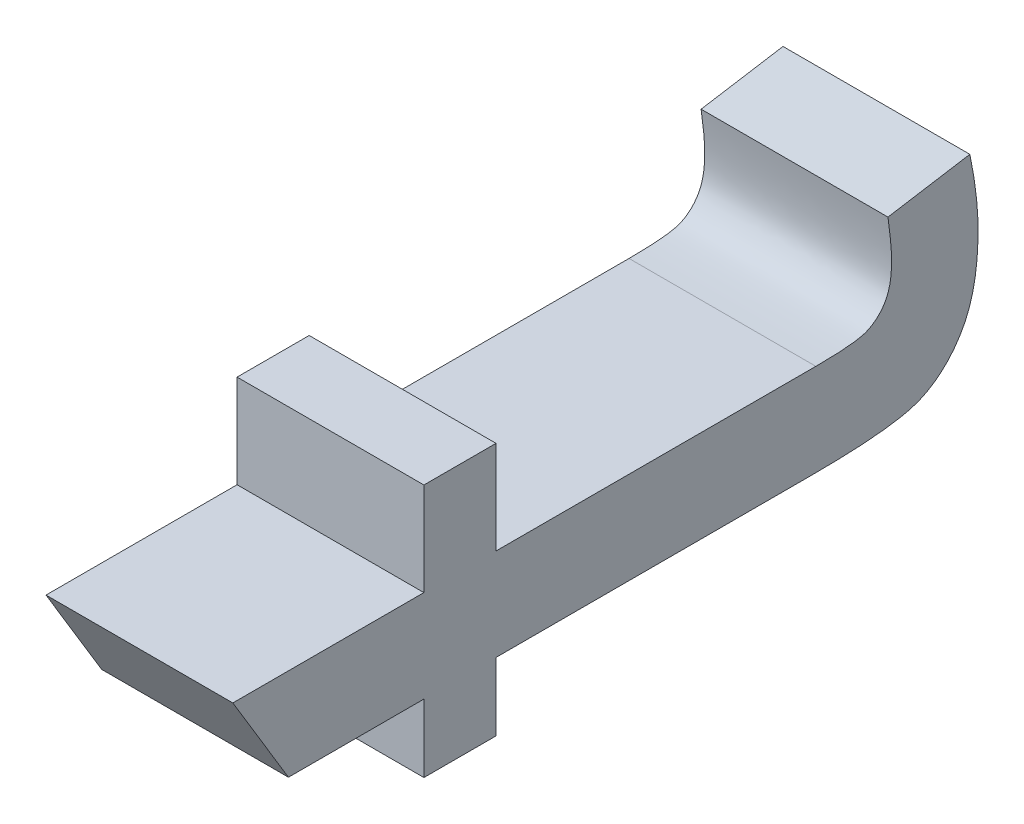
ISO-10303-21;
HEADER;
FILE_DESCRIPTION(('STEP AP214'),'2;1');
FILE_NAME('part.step','',(''),(''),'','','');
FILE_SCHEMA(('AUTOMOTIVE_DESIGN { 1 0 10303 214 1 1 1 1 }'));
ENDSEC;
DATA;
#1=APPLICATION_CONTEXT('core data for automotive mechanical design processes');
#2=APPLICATION_PROTOCOL_DEFINITION('international standard','automotive_design',2000,#1);
#3=PRODUCT_CONTEXT('',#1,'mechanical');
#4=PRODUCT('Part','Part','',(#3));
#5=PRODUCT_RELATED_PRODUCT_CATEGORY('part','',(#4));
#6=PRODUCT_DEFINITION_FORMATION('','',#4);
#7=PRODUCT_DEFINITION_CONTEXT('part definition',#1,'design');
#8=PRODUCT_DEFINITION('design','',#6,#7);
#9=PRODUCT_DEFINITION_SHAPE('','',#8);
#10=(LENGTH_UNIT() NAMED_UNIT(*) SI_UNIT(.MILLI.,.METRE.));
#11=(NAMED_UNIT(*) PLANE_ANGLE_UNIT() SI_UNIT($,.RADIAN.));
#12=(NAMED_UNIT(*) SI_UNIT($,.STERADIAN.) SOLID_ANGLE_UNIT());
#13=UNCERTAINTY_MEASURE_WITH_UNIT(LENGTH_MEASURE(1.E-05),#10,'distance_accuracy_value','');
#14=(GEOMETRIC_REPRESENTATION_CONTEXT(3) GLOBAL_UNCERTAINTY_ASSIGNED_CONTEXT((#13)) GLOBAL_UNIT_ASSIGNED_CONTEXT((#10,
#11,#12)) REPRESENTATION_CONTEXT('',''));
#15=CARTESIAN_POINT('',(0.,0.,0.));
#16=DIRECTION('',(0.,0.,1.));
#17=DIRECTION('',(1.,0.,0.));
#18=AXIS2_PLACEMENT_3D('',#15,#16,#17);
#19=CARTESIAN_POINT('',(4.55229940712883,-37.2465420082194,-8.76729471927808));
#20=DIRECTION('',(-1.,0.,0.));
#21=DIRECTION('',(0.,0.,1.));
#22=AXIS2_PLACEMENT_3D('',#19,#20,#21);
#23=PLANE('',#22);
#24=CARTESIAN_POINT('',(4.55229940712883,-37.1923071708471,-8.84692414060429));
#25=CARTESIAN_POINT('',(4.55229940712882,-37.1676361774808,-8.83203884851735));
#26=CARTESIAN_POINT('',(4.55229940712882,-37.1429651841145,-8.81715355643041));
#27=(BOUNDED_CURVE() B_SPLINE_CURVE(2,(#24,#25,#26),.UNSPECIFIED.,.F.,
.F.) B_SPLINE_CURVE_WITH_KNOTS((3,3),(30.,31.),
.UNSPECIFIED.) CURVE() GEOMETRIC_REPRESENTATION_ITEM() RATIONAL_B_SPLINE_CURVE((1.,1.,1.)) REPRESENTATION_ITEM(''));
#28=CARTESIAN_POINT('',(4.55229940712883,-37.1923071708471,-8.84692414060429));
#29=VERTEX_POINT('',#28);
#30=CARTESIAN_POINT('',(4.55229940712882,-37.1429651841145,-8.81715355643041));
#31=VERTEX_POINT('',#30);
#32=EDGE_CURVE('E287',#29,#31,#27,.T.);
#33=ORIENTED_EDGE('',*,*,#32,.T.);
#34=CARTESIAN_POINT('',(4.55229940712882,-37.1429651841145,-8.81715355643041));
#35=CARTESIAN_POINT('',(4.55229940712882,-37.1429651841145,-8.86828729128463));
#36=CARTESIAN_POINT('',(4.55229940712882,-37.1429651841145,-8.91942102613884));
#37=(BOUNDED_CURVE() B_SPLINE_CURVE(2,(#34,#35,#36),.UNSPECIFIED.,.F.,
.F.) B_SPLINE_CURVE_WITH_KNOTS((3,3),(31.,32.),
.UNSPECIFIED.) CURVE() GEOMETRIC_REPRESENTATION_ITEM() RATIONAL_B_SPLINE_CURVE((1.,1.,1.)) REPRESENTATION_ITEM(''));
#38=CARTESIAN_POINT('',(4.55229940712882,-37.1429651841145,-8.91942102613884));
#39=VERTEX_POINT('',#38);
#40=EDGE_CURVE('E125',#31,#39,#37,.T.);
#41=ORIENTED_EDGE('',*,*,#40,.T.);
#42=CARTESIAN_POINT('',(4.55229940712882,-37.1429651841145,-8.91942102613884));
#43=CARTESIAN_POINT('',(4.55229940712882,-37.118018537191,-8.91942102613884));
#44=CARTESIAN_POINT('',(4.55229940712881,-37.0930718902675,-8.91942102613884));
#45=(BOUNDED_CURVE() B_SPLINE_CURVE(2,(#42,#43,#44),.UNSPECIFIED.,.F.,
.F.) B_SPLINE_CURVE_WITH_KNOTS((3,3),(32.,33.),
.UNSPECIFIED.) CURVE() GEOMETRIC_REPRESENTATION_ITEM() RATIONAL_B_SPLINE_CURVE((1.,1.,1.)) REPRESENTATION_ITEM(''));
#46=CARTESIAN_POINT('',(4.55229940712881,-37.0930718902675,-8.91942102613884));
#47=VERTEX_POINT('',#46);
#48=EDGE_CURVE('E122',#39,#47,#45,.T.);
#49=ORIENTED_EDGE('',*,*,#48,.T.);
#50=CARTESIAN_POINT('',(4.55229940712881,-37.0930718902675,-8.91942102613884));
#51=CARTESIAN_POINT('',(4.55229940712881,-37.0930718902675,-8.93871677514042));
#52=CARTESIAN_POINT('',(4.55229940712881,-37.0930718902675,-8.95801252414201));
#53=(BOUNDED_CURVE() B_SPLINE_CURVE(2,(#50,#51,#52),.UNSPECIFIED.,.F.,
.F.) B_SPLINE_CURVE_WITH_KNOTS((3,3),(33.,34.),
.UNSPECIFIED.) CURVE() GEOMETRIC_REPRESENTATION_ITEM() RATIONAL_B_SPLINE_CURVE((1.,1.,1.)) REPRESENTATION_ITEM(''));
#54=CARTESIAN_POINT('',(4.55229940712881,-37.0930718902675,-8.95801252414201));
#55=VERTEX_POINT('',#54);
#56=EDGE_CURVE('E107',#47,#55,#53,.T.);
#57=ORIENTED_EDGE('',*,*,#56,.T.);
#58=CARTESIAN_POINT('',(4.55229940712881,-37.0930718902675,-8.95801252414201));
#59=CARTESIAN_POINT('',(4.55229940712882,-37.118018537191,-8.95801252414201));
#60=CARTESIAN_POINT('',(4.55229940712882,-37.1429651841145,-8.95801252414201));
#61=(BOUNDED_CURVE() B_SPLINE_CURVE(2,(#58,#59,#60),.UNSPECIFIED.,.F.,
.F.) B_SPLINE_CURVE_WITH_KNOTS((3,3),(34.,35.),
.UNSPECIFIED.) CURVE() GEOMETRIC_REPRESENTATION_ITEM() RATIONAL_B_SPLINE_CURVE((1.,1.,1.)) REPRESENTATION_ITEM(''));
#62=CARTESIAN_POINT('',(4.55229940712882,-37.1429651841145,-8.95801252414201));
#63=VERTEX_POINT('',#62);
#64=EDGE_CURVE('E172',#55,#63,#61,.T.);
#65=ORIENTED_EDGE('',*,*,#64,.T.);
#66=CARTESIAN_POINT('',(4.55229940712882,-37.1429651841145,-8.95801252414201));
#67=CARTESIAN_POINT('',(4.55229940712882,-37.1429651841145,-9.04360295364191));
#68=CARTESIAN_POINT('',(4.55229940712882,-37.1429651841145,-9.12919338314181));
#69=(BOUNDED_CURVE() B_SPLINE_CURVE(2,(#66,#67,#68),.UNSPECIFIED.,.F.,
.F.) B_SPLINE_CURVE_WITH_KNOTS((3,3),(35.,36.),
.UNSPECIFIED.) CURVE() GEOMETRIC_REPRESENTATION_ITEM() RATIONAL_B_SPLINE_CURVE((1.,1.,1.)) REPRESENTATION_ITEM(''));
#70=CARTESIAN_POINT('',(4.55229940712882,-37.1429651841145,-9.12919338314181));
#71=VERTEX_POINT('',#70);
#72=EDGE_CURVE('E201',#63,#71,#69,.T.);
#73=ORIENTED_EDGE('',*,*,#72,.T.);
#74=CARTESIAN_POINT('',(4.55229940712882,-37.1429651841145,-9.12919338314181));
#75=CARTESIAN_POINT('',(4.55229940712882,-37.1429651841145,-9.15041870704355));
#76=CARTESIAN_POINT('',(4.55229940712882,-37.1403464753214,-9.1564830853012));
#77=CARTESIAN_POINT('',(4.55229940712882,-37.1377277665284,-9.16254746355884));
#78=CARTESIAN_POINT('',(4.55229940712882,-37.1318012150493,-9.16613095980199));
#79=CARTESIAN_POINT('',(4.55229940712882,-37.1258746635702,-9.16971445604514));
#80=CARTESIAN_POINT('',(4.55229940712882,-37.1148485212836,-9.16971445604514));
#81=CARTESIAN_POINT('',(4.55229940712882,-37.1065789145687,-9.16971445604514));
#82=CARTESIAN_POINT('',(4.55229940712882,-37.0930718902675,-9.16778488114498));
#83=(BOUNDED_CURVE() B_SPLINE_CURVE(2,(#74,#75,#76,#77,#78,#79,#80,#81,#82),.UNSPECIFIED.,.F.,
.F.) B_SPLINE_CURVE_WITH_KNOTS((3,2,2,2,3),(36.,37.,38.,39.,40.),
.UNSPECIFIED.) CURVE() GEOMETRIC_REPRESENTATION_ITEM() RATIONAL_B_SPLINE_CURVE((1.,1.,1.,1.,1.,
1.,1.,1.,1.)) REPRESENTATION_ITEM(''));
#84=CARTESIAN_POINT('',(4.55229940712882,-37.0930718902675,-9.16778488114498));
#85=VERTEX_POINT('',#84);
#86=EDGE_CURVE('E173',#71,#85,#83,.T.);
#87=ORIENTED_EDGE('',*,*,#86,.T.);
#88=CARTESIAN_POINT('',(4.55229940712882,-37.0930718902675,-9.16778488114498));
#89=CARTESIAN_POINT('',(4.55229940712882,-37.0894883940244,-9.18969933893964));
#90=CARTESIAN_POINT('',(4.55229940712882,-37.0859048977812,-9.21161379673431));
#91=(BOUNDED_CURVE() B_SPLINE_CURVE(2,(#88,#89,#90),.UNSPECIFIED.,.F.,
.F.) B_SPLINE_CURVE_WITH_KNOTS((3,3),(40.,41.),
.UNSPECIFIED.) CURVE() GEOMETRIC_REPRESENTATION_ITEM() RATIONAL_B_SPLINE_CURVE((1.,1.,1.)) REPRESENTATION_ITEM(''));
#92=CARTESIAN_POINT('',(4.55229940712882,-37.0859048977812,-9.21161379673431));
#93=VERTEX_POINT('',#92);
#94=EDGE_CURVE('E202',#85,#93,#91,.T.);
#95=ORIENTED_EDGE('',*,*,#94,.T.);
#96=CARTESIAN_POINT('',(4.55229940712882,-37.0859048977812,-9.21161379673431));
#97=CARTESIAN_POINT('',(4.55229940712882,-37.1068545681258,-9.21602425364895));
#98=CARTESIAN_POINT('',(4.55229940712882,-37.1233937815558,-9.21602425364895));
#99=CARTESIAN_POINT('',(4.55229940712882,-37.150407830158,-9.21602425364895));
#100=CARTESIAN_POINT('',(4.55229940712883,-37.1652931222449,-9.20747899337682));
#101=CARTESIAN_POINT('',(4.55229940712883,-37.1801784143318,-9.19893373310469));
#102=CARTESIAN_POINT('',(4.55229940712883,-37.1862427925895,-9.18501322846783));
#103=CARTESIAN_POINT('',(4.55229940712883,-37.1923071708471,-9.17109272383097));
#104=CARTESIAN_POINT('',(4.55229940712883,-37.1923071708471,-9.12643684757015));
#105=(BOUNDED_CURVE() B_SPLINE_CURVE(2,(#96,#97,#98,#99,#100,#101,#102,#103,#104),.UNSPECIFIED.,
.F.,.F.) B_SPLINE_CURVE_WITH_KNOTS((3,2,2,2,3),(41.,42.,43.,44.,45.),
.UNSPECIFIED.) CURVE() GEOMETRIC_REPRESENTATION_ITEM() RATIONAL_B_SPLINE_CURVE((1.,1.,1.,1.,1.,
1.,1.,1.,1.)) REPRESENTATION_ITEM(''));
#106=CARTESIAN_POINT('',(4.55229940712883,-37.1923071708471,-9.12643684757015));
#107=VERTEX_POINT('',#106);
#108=EDGE_CURVE('E228',#93,#107,#105,.T.);
#109=ORIENTED_EDGE('',*,*,#108,.T.);
#110=CARTESIAN_POINT('',(4.55229940712883,-37.1923071708471,-9.12643684757015));
#111=CARTESIAN_POINT('',(4.55229940712883,-37.1923071708471,-9.04222468585608));
#112=CARTESIAN_POINT('',(4.55229940712883,-37.1923071708471,-8.95801252414201));
#113=(BOUNDED_CURVE() B_SPLINE_CURVE(2,(#110,#111,#112),.UNSPECIFIED.,.F.,
.F.) B_SPLINE_CURVE_WITH_KNOTS((3,3),(45.,46.),
.UNSPECIFIED.) CURVE() GEOMETRIC_REPRESENTATION_ITEM() RATIONAL_B_SPLINE_CURVE((1.,1.,1.)) REPRESENTATION_ITEM(''));
#114=CARTESIAN_POINT('',(4.55229940712883,-37.1923071708471,-8.95801252414201));
#115=VERTEX_POINT('',#114);
#116=EDGE_CURVE('E314',#107,#115,#113,.T.);
#117=ORIENTED_EDGE('',*,*,#116,.T.);
#118=CARTESIAN_POINT('',(4.55229940712883,-37.1923071708471,-8.95801252414201));
#119=CARTESIAN_POINT('',(4.55229940712883,-37.2105003056201,-8.95801252414201));
#120=CARTESIAN_POINT('',(4.55229940712883,-37.228693440393,-8.95801252414201));
#121=(BOUNDED_CURVE() B_SPLINE_CURVE(2,(#118,#119,#120),.UNSPECIFIED.,.F.,
.F.) B_SPLINE_CURVE_WITH_KNOTS((3,3),(46.,47.),
.UNSPECIFIED.) CURVE() GEOMETRIC_REPRESENTATION_ITEM() RATIONAL_B_SPLINE_CURVE((1.,1.,1.)) REPRESENTATION_ITEM(''));
#122=CARTESIAN_POINT('',(4.55229940712883,-37.228693440393,-8.95801252414201));
#123=VERTEX_POINT('',#122);
#124=EDGE_CURVE('E146',#115,#123,#121,.T.);
#125=ORIENTED_EDGE('',*,*,#124,.T.);
#126=CARTESIAN_POINT('',(4.55229940712883,-37.228693440393,-8.95801252414201));
#127=CARTESIAN_POINT('',(4.55229940712883,-37.228693440393,-8.93871677514042));
#128=CARTESIAN_POINT('',(4.55229940712883,-37.228693440393,-8.91942102613884));
#129=(BOUNDED_CURVE() B_SPLINE_CURVE(2,(#126,#127,#128),.UNSPECIFIED.,.F.,
.F.) B_SPLINE_CURVE_WITH_KNOTS((3,3),(47.,48.),
.UNSPECIFIED.) CURVE() GEOMETRIC_REPRESENTATION_ITEM() RATIONAL_B_SPLINE_CURVE((1.,1.,1.)) REPRESENTATION_ITEM(''));
#130=CARTESIAN_POINT('',(4.55229940712883,-37.228693440393,-8.91942102613884));
#131=VERTEX_POINT('',#130);
#132=EDGE_CURVE('E339',#123,#131,#129,.T.);
#133=ORIENTED_EDGE('',*,*,#132,.T.);
#134=CARTESIAN_POINT('',(4.55229940712883,-37.228693440393,-8.91942102613884));
#135=CARTESIAN_POINT('',(4.55229940712883,-37.2105003056201,-8.91942102613883));
#136=CARTESIAN_POINT('',(4.55229940712883,-37.1923071708471,-8.91942102613884));
#137=(BOUNDED_CURVE() B_SPLINE_CURVE(2,(#134,#135,#136),.UNSPECIFIED.,.F.,
.F.) B_SPLINE_CURVE_WITH_KNOTS((3,3),(48.,49.),
.UNSPECIFIED.) CURVE() GEOMETRIC_REPRESENTATION_ITEM() RATIONAL_B_SPLINE_CURVE((1.,1.,1.)) REPRESENTATION_ITEM(''));
#138=CARTESIAN_POINT('',(4.55229940712883,-37.1923071708471,-8.91942102613884));
#139=VERTEX_POINT('',#138);
#140=EDGE_CURVE('E184',#131,#139,#137,.T.);
#141=ORIENTED_EDGE('',*,*,#140,.T.);
#142=CARTESIAN_POINT('',(4.55229940712883,-37.1923071708471,-8.91942102613884));
#143=CARTESIAN_POINT('',(4.55229940712883,-37.1923071708471,-8.88317258337156));
#144=CARTESIAN_POINT('',(4.55229940712883,-37.1923071708471,-8.84692414060429));
#145=(BOUNDED_CURVE() B_SPLINE_CURVE(2,(#142,#143,#144),.UNSPECIFIED.,.F.,
.F.) B_SPLINE_CURVE_WITH_KNOTS((3,3),(49.,50.),
.UNSPECIFIED.) CURVE() GEOMETRIC_REPRESENTATION_ITEM() RATIONAL_B_SPLINE_CURVE((1.,1.,1.)) REPRESENTATION_ITEM(''));
#146=EDGE_CURVE('E11',#139,#29,#145,.T.);
#147=ORIENTED_EDGE('',*,*,#146,.T.);
#148=EDGE_LOOP('',(#33,#41,#49,#57,#65,#73,#87,#95,#109,#117,#125,#133,#141,#147));
#149=FACE_BOUND('',#148,.T.);
#150=ADVANCED_FACE('F16',(#149),#23,.T.);
#151=CARTESIAN_POINT('',(4.65229940712883,-37.2465420082194,-8.76729471927809));
#152=DIRECTION('',(1.,0.,0.));
#153=DIRECTION('',(0.,1.,0.));
#154=AXIS2_PLACEMENT_3D('',#151,#152,#153);
#155=PLANE('',#154);
#156=CARTESIAN_POINT('',(4.65229940712883,-37.1923071708471,-8.91942102613884));
#157=CARTESIAN_POINT('',(4.65229940712883,-37.1923071708471,-8.88317258337156));
#158=CARTESIAN_POINT('',(4.65229940712883,-37.1923071708471,-8.84692414060429));
#159=(BOUNDED_CURVE() B_SPLINE_CURVE(2,(#156,#157,#158),.UNSPECIFIED.,.F.,
.F.) B_SPLINE_CURVE_WITH_KNOTS((3,3),(49.,50.),
.UNSPECIFIED.) CURVE() GEOMETRIC_REPRESENTATION_ITEM() RATIONAL_B_SPLINE_CURVE((1.,1.,1.)) REPRESENTATION_ITEM(''));
#160=CARTESIAN_POINT('',(4.65229940712883,-37.1923071708471,-8.91942102613884));
#161=VERTEX_POINT('',#160);
#162=CARTESIAN_POINT('',(4.65229940712883,-37.1923071708471,-8.84692414060429));
#163=VERTEX_POINT('',#162);
#164=EDGE_CURVE('E22',#161,#163,#159,.T.);
#165=ORIENTED_EDGE('',*,*,#164,.F.);
#166=CARTESIAN_POINT('',(4.65229940712883,-37.228693440393,-8.91942102613884));
#167=CARTESIAN_POINT('',(4.65229940712883,-37.21050030562,-8.91942102613884));
#168=CARTESIAN_POINT('',(4.65229940712883,-37.1923071708471,-8.91942102613884));
#169=(BOUNDED_CURVE() B_SPLINE_CURVE(2,(#166,#167,#168),.UNSPECIFIED.,.F.,
.F.) B_SPLINE_CURVE_WITH_KNOTS((3,3),(48.,49.),
.UNSPECIFIED.) CURVE() GEOMETRIC_REPRESENTATION_ITEM() RATIONAL_B_SPLINE_CURVE((1.,1.,1.)) REPRESENTATION_ITEM(''));
#170=CARTESIAN_POINT('',(4.65229940712883,-37.228693440393,-8.91942102613884));
#171=VERTEX_POINT('',#170);
#172=EDGE_CURVE('E385',#171,#161,#169,.T.);
#173=ORIENTED_EDGE('',*,*,#172,.F.);
#174=CARTESIAN_POINT('',(4.65229940712883,-37.228693440393,-8.95801252414201));
#175=CARTESIAN_POINT('',(4.65229940712883,-37.228693440393,-8.93871677514042));
#176=CARTESIAN_POINT('',(4.65229940712883,-37.228693440393,-8.91942102613884));
#177=(BOUNDED_CURVE() B_SPLINE_CURVE(2,(#174,#175,#176),.UNSPECIFIED.,.F.,
.F.) B_SPLINE_CURVE_WITH_KNOTS((3,3),(47.,48.),
.UNSPECIFIED.) CURVE() GEOMETRIC_REPRESENTATION_ITEM() RATIONAL_B_SPLINE_CURVE((1.,1.,1.)) REPRESENTATION_ITEM(''));
#178=CARTESIAN_POINT('',(4.65229940712883,-37.228693440393,-8.95801252414201));
#179=VERTEX_POINT('',#178);
#180=EDGE_CURVE('E218',#179,#171,#177,.T.);
#181=ORIENTED_EDGE('',*,*,#180,.F.);
#182=CARTESIAN_POINT('',(4.65229940712883,-37.1923071708471,-8.95801252414201));
#183=CARTESIAN_POINT('',(4.65229940712883,-37.21050030562,-8.95801252414201));
#184=CARTESIAN_POINT('',(4.65229940712883,-37.228693440393,-8.95801252414201));
#185=(BOUNDED_CURVE() B_SPLINE_CURVE(2,(#182,#183,#184),.UNSPECIFIED.,.F.,
.F.) B_SPLINE_CURVE_WITH_KNOTS((3,3),(46.,47.),
.UNSPECIFIED.) CURVE() GEOMETRIC_REPRESENTATION_ITEM() RATIONAL_B_SPLINE_CURVE((1.,1.,1.)) REPRESENTATION_ITEM(''));
#186=CARTESIAN_POINT('',(4.65229940712883,-37.1923071708471,-8.95801252414201));
#187=VERTEX_POINT('',#186);
#188=EDGE_CURVE('E304',#187,#179,#185,.T.);
#189=ORIENTED_EDGE('',*,*,#188,.F.);
#190=CARTESIAN_POINT('',(4.65229940712883,-37.1923071708471,-9.12643684757015));
#191=CARTESIAN_POINT('',(4.65229940712883,-37.1923071708471,-9.04222468585608));
#192=CARTESIAN_POINT('',(4.65229940712883,-37.1923071708471,-8.95801252414201));
#193=(BOUNDED_CURVE() B_SPLINE_CURVE(2,(#190,#191,#192),.UNSPECIFIED.,.F.,
.F.) B_SPLINE_CURVE_WITH_KNOTS((3,3),(45.,46.),
.UNSPECIFIED.) CURVE() GEOMETRIC_REPRESENTATION_ITEM() RATIONAL_B_SPLINE_CURVE((1.,1.,1.)) REPRESENTATION_ITEM(''));
#194=CARTESIAN_POINT('',(4.65229940712883,-37.1923071708471,-9.12643684757015));
#195=VERTEX_POINT('',#194);
#196=EDGE_CURVE('E236',#195,#187,#193,.T.);
#197=ORIENTED_EDGE('',*,*,#196,.F.);
#198=CARTESIAN_POINT('',(4.65229940712882,-37.0859048977812,-9.21161379673431));
#199=CARTESIAN_POINT('',(4.65229940712882,-37.1068545681258,-9.21602425364895));
#200=CARTESIAN_POINT('',(4.65229940712882,-37.1233937815557,-9.21602425364895));
#201=CARTESIAN_POINT('',(4.65229940712883,-37.150407830158,-9.21602425364895));
#202=CARTESIAN_POINT('',(4.65229940712883,-37.1652931222449,-9.20747899337683));
#203=CARTESIAN_POINT('',(4.65229940712883,-37.1801784143318,-9.19893373310469));
#204=CARTESIAN_POINT('',(4.65229940712883,-37.1862427925895,-9.18501322846783));
#205=CARTESIAN_POINT('',(4.65229940712883,-37.1923071708471,-9.17109272383097));
#206=CARTESIAN_POINT('',(4.65229940712883,-37.1923071708471,-9.12643684757015));
#207=(BOUNDED_CURVE() B_SPLINE_CURVE(2,(#198,#199,#200,#201,#202,#203,#204,#205,#206),
.UNSPECIFIED.,.F.,.F.) B_SPLINE_CURVE_WITH_KNOTS((3,2,2,2,3),(41.,42.,43.,44.,45.),
.UNSPECIFIED.) CURVE() GEOMETRIC_REPRESENTATION_ITEM() RATIONAL_B_SPLINE_CURVE((1.,1.,1.,1.,1.,
1.,1.,1.,1.)) REPRESENTATION_ITEM(''));
#208=CARTESIAN_POINT('',(4.65229940712882,-37.0859048977812,-9.21161379673431));
#209=VERTEX_POINT('',#208);
#210=EDGE_CURVE('E210',#209,#195,#207,.T.);
#211=ORIENTED_EDGE('',*,*,#210,.F.);
#212=CARTESIAN_POINT('',(4.65229940712882,-37.0930718902675,-9.16778488114499));
#213=CARTESIAN_POINT('',(4.65229940712882,-37.0894883940244,-9.18969933893964));
#214=CARTESIAN_POINT('',(4.65229940712882,-37.0859048977812,-9.21161379673431));
#215=(BOUNDED_CURVE() B_SPLINE_CURVE(2,(#212,#213,#214),.UNSPECIFIED.,.F.,
.F.) B_SPLINE_CURVE_WITH_KNOTS((3,3),(40.,41.),
.UNSPECIFIED.) CURVE() GEOMETRIC_REPRESENTATION_ITEM() RATIONAL_B_SPLINE_CURVE((1.,1.,1.)) REPRESENTATION_ITEM(''));
#216=CARTESIAN_POINT('',(4.65229940712882,-37.0930718902675,-9.16778488114499));
#217=VERTEX_POINT('',#216);
#218=EDGE_CURVE('E182',#217,#209,#215,.T.);
#219=ORIENTED_EDGE('',*,*,#218,.F.);
#220=CARTESIAN_POINT('',(4.65229940712882,-37.1429651841145,-9.12919338314181));
#221=CARTESIAN_POINT('',(4.65229940712882,-37.1429651841145,-9.15041870704355));
#222=CARTESIAN_POINT('',(4.65229940712882,-37.1403464753214,-9.1564830853012));
#223=CARTESIAN_POINT('',(4.65229940712882,-37.1377277665283,-9.16254746355884));
#224=CARTESIAN_POINT('',(4.65229940712882,-37.1318012150493,-9.166130959802));
#225=CARTESIAN_POINT('',(4.65229940712882,-37.1258746635702,-9.16971445604514));
#226=CARTESIAN_POINT('',(4.65229940712882,-37.1148485212836,-9.16971445604514));
#227=CARTESIAN_POINT('',(4.65229940712882,-37.1065789145686,-9.16971445604514));
#228=CARTESIAN_POINT('',(4.65229940712882,-37.0930718902675,-9.16778488114499));
#229=(BOUNDED_CURVE() B_SPLINE_CURVE(2,(#220,#221,#222,#223,#224,#225,#226,#227,#228),
.UNSPECIFIED.,.F.,.F.) B_SPLINE_CURVE_WITH_KNOTS((3,2,2,2,3),(36.,37.,38.,39.,40.),
.UNSPECIFIED.) CURVE() GEOMETRIC_REPRESENTATION_ITEM() RATIONAL_B_SPLINE_CURVE((1.,1.,1.,1.,1.,
1.,1.,1.,1.)) REPRESENTATION_ITEM(''));
#230=CARTESIAN_POINT('',(4.65229940712882,-37.1429651841145,-9.12919338314181));
#231=VERTEX_POINT('',#230);
#232=EDGE_CURVE('E245',#231,#217,#229,.T.);
#233=ORIENTED_EDGE('',*,*,#232,.F.);
#234=CARTESIAN_POINT('',(4.65229940712882,-37.1429651841145,-8.95801252414201));
#235=CARTESIAN_POINT('',(4.65229940712882,-37.1429651841145,-9.04360295364191));
#236=CARTESIAN_POINT('',(4.65229940712882,-37.1429651841145,-9.12919338314181));
#237=(BOUNDED_CURVE() B_SPLINE_CURVE(2,(#234,#235,#236),.UNSPECIFIED.,.F.,
.F.) B_SPLINE_CURVE_WITH_KNOTS((3,3),(35.,36.),
.UNSPECIFIED.) CURVE() GEOMETRIC_REPRESENTATION_ITEM() RATIONAL_B_SPLINE_CURVE((1.,1.,1.)) REPRESENTATION_ITEM(''));
#238=CARTESIAN_POINT('',(4.65229940712882,-37.1429651841145,-8.95801252414201));
#239=VERTEX_POINT('',#238);
#240=EDGE_CURVE('E162',#239,#231,#237,.T.);
#241=ORIENTED_EDGE('',*,*,#240,.F.);
#242=CARTESIAN_POINT('',(4.65229940712881,-37.0930718902675,-8.95801252414201));
#243=CARTESIAN_POINT('',(4.65229940712882,-37.118018537191,-8.95801252414201));
#244=CARTESIAN_POINT('',(4.65229940712882,-37.1429651841145,-8.95801252414201));
#245=(BOUNDED_CURVE() B_SPLINE_CURVE(2,(#242,#243,#244),.UNSPECIFIED.,.F.,
.F.) B_SPLINE_CURVE_WITH_KNOTS((3,3),(34.,35.),
.UNSPECIFIED.) CURVE() GEOMETRIC_REPRESENTATION_ITEM() RATIONAL_B_SPLINE_CURVE((1.,1.,1.)) REPRESENTATION_ITEM(''));
#246=CARTESIAN_POINT('',(4.65229940712881,-37.0930718902675,-8.95801252414201));
#247=VERTEX_POINT('',#246);
#248=EDGE_CURVE('E119',#247,#239,#245,.T.);
#249=ORIENTED_EDGE('',*,*,#248,.F.);
#250=CARTESIAN_POINT('',(4.65229940712881,-37.0930718902675,-8.91942102613884));
#251=CARTESIAN_POINT('',(4.65229940712881,-37.0930718902675,-8.93871677514042));
#252=CARTESIAN_POINT('',(4.65229940712881,-37.0930718902675,-8.95801252414201));
#253=(BOUNDED_CURVE() B_SPLINE_CURVE(2,(#250,#251,#252),.UNSPECIFIED.,.F.,
.F.) B_SPLINE_CURVE_WITH_KNOTS((3,3),(33.,34.),
.UNSPECIFIED.) CURVE() GEOMETRIC_REPRESENTATION_ITEM() RATIONAL_B_SPLINE_CURVE((1.,1.,1.)) REPRESENTATION_ITEM(''));
#254=CARTESIAN_POINT('',(4.65229940712881,-37.0930718902675,-8.91942102613884));
#255=VERTEX_POINT('',#254);
#256=EDGE_CURVE('E130',#255,#247,#253,.T.);
#257=ORIENTED_EDGE('',*,*,#256,.F.);
#258=CARTESIAN_POINT('',(4.65229940712882,-37.1429651841145,-8.91942102613884));
#259=CARTESIAN_POINT('',(4.65229940712882,-37.118018537191,-8.91942102613884));
#260=CARTESIAN_POINT('',(4.65229940712881,-37.0930718902675,-8.91942102613884));
#261=(BOUNDED_CURVE() B_SPLINE_CURVE(2,(#258,#259,#260),.UNSPECIFIED.,.F.,
.F.) B_SPLINE_CURVE_WITH_KNOTS((3,3),(32.,33.),
.UNSPECIFIED.) CURVE() GEOMETRIC_REPRESENTATION_ITEM() RATIONAL_B_SPLINE_CURVE((1.,1.,1.)) REPRESENTATION_ITEM(''));
#262=CARTESIAN_POINT('',(4.65229940712882,-37.1429651841145,-8.91942102613884));
#263=VERTEX_POINT('',#262);
#264=EDGE_CURVE('E134',#263,#255,#261,.T.);
#265=ORIENTED_EDGE('',*,*,#264,.F.);
#266=CARTESIAN_POINT('',(4.65229940712882,-37.1429651841145,-8.81715355643041));
#267=CARTESIAN_POINT('',(4.65229940712882,-37.1429651841145,-8.86828729128463));
#268=CARTESIAN_POINT('',(4.65229940712882,-37.1429651841145,-8.91942102613884));
#269=(BOUNDED_CURVE() B_SPLINE_CURVE(2,(#266,#267,#268),.UNSPECIFIED.,.F.,
.F.) B_SPLINE_CURVE_WITH_KNOTS((3,3),(31.,32.),
.UNSPECIFIED.) CURVE() GEOMETRIC_REPRESENTATION_ITEM() RATIONAL_B_SPLINE_CURVE((1.,1.,1.)) REPRESENTATION_ITEM(''));
#270=CARTESIAN_POINT('',(4.65229940712882,-37.1429651841145,-8.81715355643041));
#271=VERTEX_POINT('',#270);
#272=EDGE_CURVE('E371',#271,#263,#269,.T.);
#273=ORIENTED_EDGE('',*,*,#272,.F.);
#274=CARTESIAN_POINT('',(4.65229940712883,-37.1923071708471,-8.84692414060429));
#275=CARTESIAN_POINT('',(4.65229940712882,-37.1676361774808,-8.83203884851736));
#276=CARTESIAN_POINT('',(4.65229940712882,-37.1429651841145,-8.81715355643041));
#277=(BOUNDED_CURVE() B_SPLINE_CURVE(2,(#274,#275,#276),.UNSPECIFIED.,.F.,
.F.) B_SPLINE_CURVE_WITH_KNOTS((3,3),(30.,31.),
.UNSPECIFIED.) CURVE() GEOMETRIC_REPRESENTATION_ITEM() RATIONAL_B_SPLINE_CURVE((1.,1.,1.)) REPRESENTATION_ITEM(''));
#278=EDGE_CURVE('E270',#163,#271,#277,.T.);
#279=ORIENTED_EDGE('',*,*,#278,.F.);
#280=EDGE_LOOP('',(#165,#173,#181,#189,#197,#211,#219,#233,#241,#249,#257,#265,#273,#279));
#281=FACE_BOUND('',#280,.T.);
#282=ADVANCED_FACE('F487',(#281),#155,.T.);
#283=CARTESIAN_POINT('',(4.65229940712883,-37.1923071708471,-8.91942102613884));
#284=CARTESIAN_POINT('',(4.55229940712883,-37.1923071708471,-8.91942102613884));
#285=CARTESIAN_POINT('',(4.65229940712883,-37.1923071708471,-8.88317258337156));
#286=CARTESIAN_POINT('',(4.55229940712883,-37.1923071708471,-8.88317258337156));
#287=CARTESIAN_POINT('',(4.65229940712883,-37.1923071708471,-8.84692414060429));
#288=CARTESIAN_POINT('',(4.55229940712883,-37.1923071708471,-8.84692414060429));
#289=(BOUNDED_SURFACE() B_SPLINE_SURFACE(2,1,((#283,#284),(#285,#286),(#287,#288)),
.UNSPECIFIED.,.F.,.F.,.F.) B_SPLINE_SURFACE_WITH_KNOTS((3,3),(2,2),(49.,50.),(0.,0.1),
.UNSPECIFIED.) GEOMETRIC_REPRESENTATION_ITEM() RATIONAL_B_SPLINE_SURFACE(((1.,1.),(1.,1.),(1.,1.))) REPRESENTATION_ITEM('') SURFACE());
#290=CARTESIAN_POINT('',(4.65229940712883,-37.1923071708471,-8.84692414060429));
#291=CARTESIAN_POINT('',(4.55229940712883,-37.1923071708471,-8.84692414060429));
#292=(BOUNDED_CURVE() B_SPLINE_CURVE(1,(#290,#291),.UNSPECIFIED.,.F.,
.F.) B_SPLINE_CURVE_WITH_KNOTS((2,2),(0.,0.1),
.UNSPECIFIED.) CURVE() GEOMETRIC_REPRESENTATION_ITEM() RATIONAL_B_SPLINE_CURVE((1.,1.)) REPRESENTATION_ITEM(''));
#293=EDGE_CURVE('E406',#163,#29,#292,.T.);
#294=CARTESIAN_POINT('',(4.65229940712883,-37.1923071708471,-8.91942102613884));
#295=CARTESIAN_POINT('',(4.55229940712883,-37.1923071708471,-8.91942102613884));
#296=(BOUNDED_CURVE() B_SPLINE_CURVE(1,(#294,#295),.UNSPECIFIED.,.F.,
.F.) B_SPLINE_CURVE_WITH_KNOTS((2,2),(0.,0.1),
.UNSPECIFIED.) CURVE() GEOMETRIC_REPRESENTATION_ITEM() RATIONAL_B_SPLINE_CURVE((1.,1.)) REPRESENTATION_ITEM(''));
#297=EDGE_CURVE('E192',#161,#139,#296,.T.);
#298=ORIENTED_EDGE('',*,*,#164,.T.);
#299=ORIENTED_EDGE('',*,*,#293,.T.);
#300=ORIENTED_EDGE('',*,*,#146,.F.);
#301=ORIENTED_EDGE('',*,*,#297,.F.);
#302=EDGE_LOOP('',(#298,#299,#300,#301));
#303=FACE_BOUND('',#302,.T.);
#304=ADVANCED_FACE('F547',(#303),#289,.T.);
#305=CARTESIAN_POINT('',(4.65229940712883,-37.228693440393,-8.91942102613884));
#306=CARTESIAN_POINT('',(4.55229940712883,-37.228693440393,-8.91942102613884));
#307=CARTESIAN_POINT('',(4.65229940712883,-37.21050030562,-8.91942102613884));
#308=CARTESIAN_POINT('',(4.55229940712883,-37.2105003056201,-8.91942102613883));
#309=CARTESIAN_POINT('',(4.65229940712883,-37.1923071708471,-8.91942102613884));
#310=CARTESIAN_POINT('',(4.55229940712883,-37.1923071708471,-8.91942102613884));
#311=(BOUNDED_SURFACE() B_SPLINE_SURFACE(2,1,((#305,#306),(#307,#308),(#309,#310)),
.UNSPECIFIED.,.F.,.F.,.F.) B_SPLINE_SURFACE_WITH_KNOTS((3,3),(2,2),(48.,49.),(0.,0.1),
.UNSPECIFIED.) GEOMETRIC_REPRESENTATION_ITEM() RATIONAL_B_SPLINE_SURFACE(((1.,1.),(1.,1.),(1.,1.))) REPRESENTATION_ITEM('') SURFACE());
#312=CARTESIAN_POINT('',(4.65229940712883,-37.228693440393,-8.91942102613884));
#313=CARTESIAN_POINT('',(4.55229940712883,-37.228693440393,-8.91942102613884));
#314=(BOUNDED_CURVE() B_SPLINE_CURVE(1,(#312,#313),.UNSPECIFIED.,.F.,
.F.) B_SPLINE_CURVE_WITH_KNOTS((2,2),(0.,0.1),
.UNSPECIFIED.) CURVE() GEOMETRIC_REPRESENTATION_ITEM() RATIONAL_B_SPLINE_CURVE((1.,1.)) REPRESENTATION_ITEM(''));
#315=EDGE_CURVE('E227',#171,#131,#314,.T.);
#316=ORIENTED_EDGE('',*,*,#172,.T.);
#317=ORIENTED_EDGE('',*,*,#297,.T.);
#318=ORIENTED_EDGE('',*,*,#140,.F.);
#319=ORIENTED_EDGE('',*,*,#315,.F.);
#320=EDGE_LOOP('',(#316,#317,#318,#319));
#321=FACE_BOUND('',#320,.T.);
#322=ADVANCED_FACE('F543',(#321),#311,.T.);
#323=CARTESIAN_POINT('',(4.65229940712883,-37.228693440393,-8.95801252414201));
#324=CARTESIAN_POINT('',(4.55229940712883,-37.228693440393,-8.95801252414201));
#325=CARTESIAN_POINT('',(4.65229940712883,-37.228693440393,-8.93871677514042));
#326=CARTESIAN_POINT('',(4.55229940712883,-37.228693440393,-8.93871677514042));
#327=CARTESIAN_POINT('',(4.65229940712883,-37.228693440393,-8.91942102613884));
#328=CARTESIAN_POINT('',(4.55229940712883,-37.228693440393,-8.91942102613884));
#329=(BOUNDED_SURFACE() B_SPLINE_SURFACE(2,1,((#323,#324),(#325,#326),(#327,#328)),
.UNSPECIFIED.,.F.,.F.,.F.) B_SPLINE_SURFACE_WITH_KNOTS((3,3),(2,2),(47.,48.),(0.,0.1),
.UNSPECIFIED.) GEOMETRIC_REPRESENTATION_ITEM() RATIONAL_B_SPLINE_SURFACE(((1.,1.),(1.,1.),(1.,1.))) REPRESENTATION_ITEM('') SURFACE());
#330=CARTESIAN_POINT('',(4.65229940712883,-37.228693440393,-8.95801252414201));
#331=CARTESIAN_POINT('',(4.55229940712883,-37.228693440393,-8.95801252414201));
#332=(BOUNDED_CURVE() B_SPLINE_CURVE(1,(#330,#331),.UNSPECIFIED.,.F.,
.F.) B_SPLINE_CURVE_WITH_KNOTS((2,2),(0.,0.1),
.UNSPECIFIED.) CURVE() GEOMETRIC_REPRESENTATION_ITEM() RATIONAL_B_SPLINE_CURVE((1.,1.)) REPRESENTATION_ITEM(''));
#333=EDGE_CURVE('E313',#179,#123,#332,.T.);
#334=ORIENTED_EDGE('',*,*,#180,.T.);
#335=ORIENTED_EDGE('',*,*,#315,.T.);
#336=ORIENTED_EDGE('',*,*,#132,.F.);
#337=ORIENTED_EDGE('',*,*,#333,.F.);
#338=EDGE_LOOP('',(#334,#335,#336,#337));
#339=FACE_BOUND('',#338,.T.);
#340=ADVANCED_FACE('F578',(#339),#329,.T.);
#341=CARTESIAN_POINT('',(4.65229940712883,-37.1923071708471,-8.95801252414201));
#342=CARTESIAN_POINT('',(4.55229940712883,-37.1923071708471,-8.95801252414201));
#343=CARTESIAN_POINT('',(4.65229940712883,-37.21050030562,-8.95801252414201));
#344=CARTESIAN_POINT('',(4.55229940712883,-37.2105003056201,-8.95801252414201));
#345=CARTESIAN_POINT('',(4.65229940712883,-37.228693440393,-8.95801252414201));
#346=CARTESIAN_POINT('',(4.55229940712883,-37.228693440393,-8.95801252414201));
#347=(BOUNDED_SURFACE() B_SPLINE_SURFACE(2,1,((#341,#342),(#343,#344),(#345,#346)),
.UNSPECIFIED.,.F.,.F.,.F.) B_SPLINE_SURFACE_WITH_KNOTS((3,3),(2,2),(46.,47.),(0.,0.1),
.UNSPECIFIED.) GEOMETRIC_REPRESENTATION_ITEM() RATIONAL_B_SPLINE_SURFACE(((1.,1.),(1.,1.),(1.,1.))) REPRESENTATION_ITEM('') SURFACE());
#348=CARTESIAN_POINT('',(4.65229940712883,-37.1923071708471,-8.95801252414201));
#349=CARTESIAN_POINT('',(4.55229940712883,-37.1923071708471,-8.95801252414201));
#350=(BOUNDED_CURVE() B_SPLINE_CURVE(1,(#348,#349),.UNSPECIFIED.,.F.,
.F.) B_SPLINE_CURVE_WITH_KNOTS((2,2),(0.,0.1),
.UNSPECIFIED.) CURVE() GEOMETRIC_REPRESENTATION_ITEM() RATIONAL_B_SPLINE_CURVE((1.,1.)) REPRESENTATION_ITEM(''));
#351=EDGE_CURVE('E345',#187,#115,#350,.T.);
#352=ORIENTED_EDGE('',*,*,#188,.T.);
#353=ORIENTED_EDGE('',*,*,#333,.T.);
#354=ORIENTED_EDGE('',*,*,#124,.F.);
#355=ORIENTED_EDGE('',*,*,#351,.F.);
#356=EDGE_LOOP('',(#352,#353,#354,#355));
#357=FACE_BOUND('',#356,.T.);
#358=ADVANCED_FACE('F344',(#357),#347,.T.);
#359=CARTESIAN_POINT('',(4.65229940712883,-37.1923071708471,-9.12643684757015));
#360=CARTESIAN_POINT('',(4.55229940712883,-37.1923071708471,-9.12643684757015));
#361=CARTESIAN_POINT('',(4.65229940712883,-37.1923071708471,-9.04222468585608));
#362=CARTESIAN_POINT('',(4.55229940712883,-37.1923071708471,-9.04222468585608));
#363=CARTESIAN_POINT('',(4.65229940712883,-37.1923071708471,-8.95801252414201));
#364=CARTESIAN_POINT('',(4.55229940712883,-37.1923071708471,-8.95801252414201));
#365=(BOUNDED_SURFACE() B_SPLINE_SURFACE(2,1,((#359,#360),(#361,#362),(#363,#364)),
.UNSPECIFIED.,.F.,.F.,.F.) B_SPLINE_SURFACE_WITH_KNOTS((3,3),(2,2),(45.,46.),(0.,0.1),
.UNSPECIFIED.) GEOMETRIC_REPRESENTATION_ITEM() RATIONAL_B_SPLINE_SURFACE(((1.,1.),(1.,1.),(1.,1.))) REPRESENTATION_ITEM('') SURFACE());
#366=CARTESIAN_POINT('',(4.65229940712883,-37.1923071708471,-9.12643684757015));
#367=CARTESIAN_POINT('',(4.55229940712883,-37.1923071708471,-9.12643684757015));
#368=(BOUNDED_CURVE() B_SPLINE_CURVE(1,(#366,#367),.UNSPECIFIED.,.F.,
.F.) B_SPLINE_CURVE_WITH_KNOTS((2,2),(0.,0.1),
.UNSPECIFIED.) CURVE() GEOMETRIC_REPRESENTATION_ITEM() RATIONAL_B_SPLINE_CURVE((1.,1.)) REPRESENTATION_ITEM(''));
#369=EDGE_CURVE('E237',#195,#107,#368,.T.);
#370=ORIENTED_EDGE('',*,*,#196,.T.);
#371=ORIENTED_EDGE('',*,*,#351,.T.);
#372=ORIENTED_EDGE('',*,*,#116,.F.);
#373=ORIENTED_EDGE('',*,*,#369,.F.);
#374=EDGE_LOOP('',(#370,#371,#372,#373));
#375=FACE_BOUND('',#374,.T.);
#376=ADVANCED_FACE('F352',(#375),#365,.T.);
#377=CARTESIAN_POINT('',(4.65229940712882,-37.0859048977812,-9.21161379673431));
#378=CARTESIAN_POINT('',(4.55229940712882,-37.0859048977812,-9.21161379673431));
#379=CARTESIAN_POINT('',(4.65229940712882,-37.1068545681258,-9.21602425364895));
#380=CARTESIAN_POINT('',(4.55229940712882,-37.1068545681258,-9.21602425364895));
#381=CARTESIAN_POINT('',(4.65229940712882,-37.1233937815557,-9.21602425364895));
#382=CARTESIAN_POINT('',(4.55229940712882,-37.1233937815558,-9.21602425364895));
#383=CARTESIAN_POINT('',(4.65229940712883,-37.150407830158,-9.21602425364895));
#384=CARTESIAN_POINT('',(4.55229940712882,-37.150407830158,-9.21602425364895));
#385=CARTESIAN_POINT('',(4.65229940712883,-37.1652931222449,-9.20747899337683));
#386=CARTESIAN_POINT('',(4.55229940712883,-37.1652931222449,-9.20747899337682));
#387=CARTESIAN_POINT('',(4.65229940712883,-37.1801784143318,-9.19893373310469));
#388=CARTESIAN_POINT('',(4.55229940712883,-37.1801784143318,-9.19893373310469));
#389=CARTESIAN_POINT('',(4.65229940712883,-37.1862427925895,-9.18501322846783));
#390=CARTESIAN_POINT('',(4.55229940712883,-37.1862427925895,-9.18501322846783));
#391=CARTESIAN_POINT('',(4.65229940712883,-37.1923071708471,-9.17109272383097));
#392=CARTESIAN_POINT('',(4.55229940712883,-37.1923071708471,-9.17109272383097));
#393=CARTESIAN_POINT('',(4.65229940712883,-37.1923071708471,-9.12643684757015));
#394=CARTESIAN_POINT('',(4.55229940712883,-37.1923071708471,-9.12643684757015));
#395=(BOUNDED_SURFACE() B_SPLINE_SURFACE(2,1,((#377,#378),(#379,#380),(#381,#382),(#383,#384),
(#385,#386),(#387,#388),(#389,#390),(#391,#392),(#393,#394)),.UNSPECIFIED.,.F.,.F.,
.F.) B_SPLINE_SURFACE_WITH_KNOTS((3,2,2,2,3),(2,2),(41.,42.,43.,44.,45.),(0.,0.1),
.UNSPECIFIED.) GEOMETRIC_REPRESENTATION_ITEM() RATIONAL_B_SPLINE_SURFACE(((1.,1.),(1.,1.),(1.,
1.),(1.,1.),(1.,1.),(1.,1.),(1.,1.),(1.,1.),(1.,1.))) REPRESENTATION_ITEM('') SURFACE());
#396=CARTESIAN_POINT('',(4.65229940712882,-37.0859048977812,-9.21161379673431));
#397=CARTESIAN_POINT('',(4.55229940712882,-37.0859048977812,-9.21161379673431));
#398=(BOUNDED_CURVE() B_SPLINE_CURVE(1,(#396,#397),.UNSPECIFIED.,.F.,
.F.) B_SPLINE_CURVE_WITH_KNOTS((2,2),(0.,0.1),
.UNSPECIFIED.) CURVE() GEOMETRIC_REPRESENTATION_ITEM() RATIONAL_B_SPLINE_CURVE((1.,1.)) REPRESENTATION_ITEM(''));
#399=EDGE_CURVE('E211',#209,#93,#398,.T.);
#400=ORIENTED_EDGE('',*,*,#210,.T.);
#401=ORIENTED_EDGE('',*,*,#369,.T.);
#402=ORIENTED_EDGE('',*,*,#108,.F.);
#403=ORIENTED_EDGE('',*,*,#399,.F.);
#404=EDGE_LOOP('',(#400,#401,#402,#403));
#405=FACE_BOUND('',#404,.T.);
#406=ADVANCED_FACE('F510',(#405),#395,.T.);
#407=CARTESIAN_POINT('',(4.65229940712882,-37.0930718902675,-9.16778488114499));
#408=CARTESIAN_POINT('',(4.55229940712882,-37.0930718902675,-9.16778488114498));
#409=CARTESIAN_POINT('',(4.65229940712882,-37.0894883940244,-9.18969933893964));
#410=CARTESIAN_POINT('',(4.55229940712882,-37.0894883940244,-9.18969933893964));
#411=CARTESIAN_POINT('',(4.65229940712882,-37.0859048977812,-9.21161379673431));
#412=CARTESIAN_POINT('',(4.55229940712882,-37.0859048977812,-9.21161379673431));
#413=(BOUNDED_SURFACE() B_SPLINE_SURFACE(2,1,((#407,#408),(#409,#410),(#411,#412)),
.UNSPECIFIED.,.F.,.F.,.F.) B_SPLINE_SURFACE_WITH_KNOTS((3,3),(2,2),(40.,41.),(0.,0.1),
.UNSPECIFIED.) GEOMETRIC_REPRESENTATION_ITEM() RATIONAL_B_SPLINE_SURFACE(((1.,1.),(1.,1.),(1.,1.))) REPRESENTATION_ITEM('') SURFACE());
#414=CARTESIAN_POINT('',(4.65229940712882,-37.0930718902675,-9.16778488114499));
#415=CARTESIAN_POINT('',(4.55229940712882,-37.0930718902675,-9.16778488114498));
#416=(BOUNDED_CURVE() B_SPLINE_CURVE(1,(#414,#415),.UNSPECIFIED.,.F.,
.F.) B_SPLINE_CURVE_WITH_KNOTS((2,2),(0.,0.1),
.UNSPECIFIED.) CURVE() GEOMETRIC_REPRESENTATION_ITEM() RATIONAL_B_SPLINE_CURVE((1.,1.)) REPRESENTATION_ITEM(''));
#417=EDGE_CURVE('E183',#217,#85,#416,.T.);
#418=ORIENTED_EDGE('',*,*,#218,.T.);
#419=ORIENTED_EDGE('',*,*,#399,.T.);
#420=ORIENTED_EDGE('',*,*,#94,.F.);
#421=ORIENTED_EDGE('',*,*,#417,.F.);
#422=EDGE_LOOP('',(#418,#419,#420,#421));
#423=FACE_BOUND('',#422,.T.);
#424=ADVANCED_FACE('F507',(#423),#413,.T.);
#425=CARTESIAN_POINT('',(4.65229940712882,-37.1429651841145,-9.12919338314181));
#426=CARTESIAN_POINT('',(4.55229940712882,-37.1429651841145,-9.12919338314181));
#427=CARTESIAN_POINT('',(4.65229940712882,-37.1429651841145,-9.15041870704355));
#428=CARTESIAN_POINT('',(4.55229940712882,-37.1429651841145,-9.15041870704355));
#429=CARTESIAN_POINT('',(4.65229940712882,-37.1403464753214,-9.1564830853012));
#430=CARTESIAN_POINT('',(4.55229940712882,-37.1403464753214,-9.1564830853012));
#431=CARTESIAN_POINT('',(4.65229940712882,-37.1377277665283,-9.16254746355884));
#432=CARTESIAN_POINT('',(4.55229940712882,-37.1377277665284,-9.16254746355884));
#433=CARTESIAN_POINT('',(4.65229940712882,-37.1318012150493,-9.166130959802));
#434=CARTESIAN_POINT('',(4.55229940712882,-37.1318012150493,-9.16613095980199));
#435=CARTESIAN_POINT('',(4.65229940712882,-37.1258746635702,-9.16971445604514));
#436=CARTESIAN_POINT('',(4.55229940712882,-37.1258746635702,-9.16971445604514));
#437=CARTESIAN_POINT('',(4.65229940712882,-37.1148485212836,-9.16971445604514));
#438=CARTESIAN_POINT('',(4.55229940712882,-37.1148485212836,-9.16971445604514));
#439=CARTESIAN_POINT('',(4.65229940712882,-37.1065789145686,-9.16971445604514));
#440=CARTESIAN_POINT('',(4.55229940712882,-37.1065789145687,-9.16971445604514));
#441=CARTESIAN_POINT('',(4.65229940712882,-37.0930718902675,-9.16778488114499));
#442=CARTESIAN_POINT('',(4.55229940712882,-37.0930718902675,-9.16778488114498));
#443=(BOUNDED_SURFACE() B_SPLINE_SURFACE(2,1,((#425,#426),(#427,#428),(#429,#430),(#431,#432),
(#433,#434),(#435,#436),(#437,#438),(#439,#440),(#441,#442)),.UNSPECIFIED.,.F.,.F.,
.F.) B_SPLINE_SURFACE_WITH_KNOTS((3,2,2,2,3),(2,2),(36.,37.,38.,39.,40.),(0.,0.1),
.UNSPECIFIED.) GEOMETRIC_REPRESENTATION_ITEM() RATIONAL_B_SPLINE_SURFACE(((1.,1.),(1.,1.),(1.,
1.),(1.,1.),(1.,1.),(1.,1.),(1.,1.),(1.,1.),(1.,1.))) REPRESENTATION_ITEM('') SURFACE());
#444=CARTESIAN_POINT('',(4.65229940712882,-37.1429651841145,-9.12919338314181));
#445=CARTESIAN_POINT('',(4.55229940712882,-37.1429651841145,-9.12919338314181));
#446=(BOUNDED_CURVE() B_SPLINE_CURVE(1,(#444,#445),.UNSPECIFIED.,.F.,
.F.) B_SPLINE_CURVE_WITH_KNOTS((2,2),(0.,0.1),
.UNSPECIFIED.) CURVE() GEOMETRIC_REPRESENTATION_ITEM() RATIONAL_B_SPLINE_CURVE((1.,1.)) REPRESENTATION_ITEM(''));
#447=EDGE_CURVE('E171',#231,#71,#446,.T.);
#448=ORIENTED_EDGE('',*,*,#232,.T.);
#449=ORIENTED_EDGE('',*,*,#417,.T.);
#450=ORIENTED_EDGE('',*,*,#86,.F.);
#451=ORIENTED_EDGE('',*,*,#447,.F.);
#452=EDGE_LOOP('',(#448,#449,#450,#451));
#453=FACE_BOUND('',#452,.T.);
#454=ADVANCED_FACE('F499',(#453),#443,.T.);
#455=CARTESIAN_POINT('',(4.65229940712882,-37.1429651841145,-8.95801252414201));
#456=CARTESIAN_POINT('',(4.55229940712882,-37.1429651841145,-8.95801252414201));
#457=CARTESIAN_POINT('',(4.65229940712882,-37.1429651841145,-9.04360295364191));
#458=CARTESIAN_POINT('',(4.55229940712882,-37.1429651841145,-9.04360295364191));
#459=CARTESIAN_POINT('',(4.65229940712882,-37.1429651841145,-9.12919338314181));
#460=CARTESIAN_POINT('',(4.55229940712882,-37.1429651841145,-9.12919338314181));
#461=(BOUNDED_SURFACE() B_SPLINE_SURFACE(2,1,((#455,#456),(#457,#458),(#459,#460)),
.UNSPECIFIED.,.F.,.F.,.F.) B_SPLINE_SURFACE_WITH_KNOTS((3,3),(2,2),(35.,36.),(0.,0.1),
.UNSPECIFIED.) GEOMETRIC_REPRESENTATION_ITEM() RATIONAL_B_SPLINE_SURFACE(((1.,1.),(1.,1.),(1.,1.))) REPRESENTATION_ITEM('') SURFACE());
#462=CARTESIAN_POINT('',(4.65229940712882,-37.1429651841145,-8.95801252414201));
#463=CARTESIAN_POINT('',(4.55229940712882,-37.1429651841145,-8.95801252414201));
#464=(BOUNDED_CURVE() B_SPLINE_CURVE(1,(#462,#463),.UNSPECIFIED.,.F.,
.F.) B_SPLINE_CURVE_WITH_KNOTS((2,2),(0.,0.1),
.UNSPECIFIED.) CURVE() GEOMETRIC_REPRESENTATION_ITEM() RATIONAL_B_SPLINE_CURVE((1.,1.)) REPRESENTATION_ITEM(''));
#465=EDGE_CURVE('E266',#239,#63,#464,.T.);
#466=ORIENTED_EDGE('',*,*,#240,.T.);
#467=ORIENTED_EDGE('',*,*,#447,.T.);
#468=ORIENTED_EDGE('',*,*,#72,.F.);
#469=ORIENTED_EDGE('',*,*,#465,.F.);
#470=EDGE_LOOP('',(#466,#467,#468,#469));
#471=FACE_BOUND('',#470,.T.);
#472=ADVANCED_FACE('F496',(#471),#461,.T.);
#473=CARTESIAN_POINT('',(4.65229940712881,-37.0930718902675,-8.95801252414201));
#474=CARTESIAN_POINT('',(4.55229940712881,-37.0930718902675,-8.95801252414201));
#475=CARTESIAN_POINT('',(4.65229940712882,-37.118018537191,-8.95801252414201));
#476=CARTESIAN_POINT('',(4.55229940712882,-37.118018537191,-8.95801252414201));
#477=CARTESIAN_POINT('',(4.65229940712882,-37.1429651841145,-8.95801252414201));
#478=CARTESIAN_POINT('',(4.55229940712882,-37.1429651841145,-8.95801252414201));
#479=(BOUNDED_SURFACE() B_SPLINE_SURFACE(2,1,((#473,#474),(#475,#476),(#477,#478)),
.UNSPECIFIED.,.F.,.F.,.F.) B_SPLINE_SURFACE_WITH_KNOTS((3,3),(2,2),(34.,35.),(0.,0.1),
.UNSPECIFIED.) GEOMETRIC_REPRESENTATION_ITEM() RATIONAL_B_SPLINE_SURFACE(((1.,1.),(1.,1.),(1.,1.))) REPRESENTATION_ITEM('') SURFACE());
#480=CARTESIAN_POINT('',(4.65229940712881,-37.0930718902675,-8.95801252414201));
#481=CARTESIAN_POINT('',(4.55229940712881,-37.0930718902675,-8.95801252414201));
#482=(BOUNDED_CURVE() B_SPLINE_CURVE(1,(#480,#481),.UNSPECIFIED.,.F.,
.F.) B_SPLINE_CURVE_WITH_KNOTS((2,2),(0.,0.1),
.UNSPECIFIED.) CURVE() GEOMETRIC_REPRESENTATION_ITEM() RATIONAL_B_SPLINE_CURVE((1.,1.)) REPRESENTATION_ITEM(''));
#483=EDGE_CURVE('E115',#247,#55,#482,.T.);
#484=ORIENTED_EDGE('',*,*,#248,.T.);
#485=ORIENTED_EDGE('',*,*,#465,.T.);
#486=ORIENTED_EDGE('',*,*,#64,.F.);
#487=ORIENTED_EDGE('',*,*,#483,.F.);
#488=EDGE_LOOP('',(#484,#485,#486,#487));
#489=FACE_BOUND('',#488,.T.);
#490=ADVANCED_FACE('F18',(#489),#479,.T.);
#491=CARTESIAN_POINT('',(4.65229940712881,-37.0930718902675,-8.91942102613884));
#492=CARTESIAN_POINT('',(4.55229940712881,-37.0930718902675,-8.91942102613884));
#493=CARTESIAN_POINT('',(4.65229940712881,-37.0930718902675,-8.93871677514042));
#494=CARTESIAN_POINT('',(4.55229940712881,-37.0930718902675,-8.93871677514042));
#495=CARTESIAN_POINT('',(4.65229940712881,-37.0930718902675,-8.95801252414201));
#496=CARTESIAN_POINT('',(4.55229940712881,-37.0930718902675,-8.95801252414201));
#497=(BOUNDED_SURFACE() B_SPLINE_SURFACE(2,1,((#491,#492),(#493,#494),(#495,#496)),
.UNSPECIFIED.,.F.,.F.,.F.) B_SPLINE_SURFACE_WITH_KNOTS((3,3),(2,2),(33.,34.),(0.,0.1),
.UNSPECIFIED.) GEOMETRIC_REPRESENTATION_ITEM() RATIONAL_B_SPLINE_SURFACE(((1.,1.),(1.,1.),(1.,1.))) REPRESENTATION_ITEM('') SURFACE());
#498=CARTESIAN_POINT('',(4.65229940712881,-37.0930718902675,-8.91942102613884));
#499=CARTESIAN_POINT('',(4.55229940712881,-37.0930718902675,-8.91942102613884));
#500=(BOUNDED_CURVE() B_SPLINE_CURVE(1,(#498,#499),.UNSPECIFIED.,.F.,
.F.) B_SPLINE_CURVE_WITH_KNOTS((2,2),(0.,0.1),
.UNSPECIFIED.) CURVE() GEOMETRIC_REPRESENTATION_ITEM() RATIONAL_B_SPLINE_CURVE((1.,1.)) REPRESENTATION_ITEM(''));
#501=EDGE_CURVE('E112',#255,#47,#500,.T.);
#502=ORIENTED_EDGE('',*,*,#256,.T.);
#503=ORIENTED_EDGE('',*,*,#483,.T.);
#504=ORIENTED_EDGE('',*,*,#56,.F.);
#505=ORIENTED_EDGE('',*,*,#501,.F.);
#506=EDGE_LOOP('',(#502,#503,#504,#505));
#507=FACE_BOUND('',#506,.T.);
#508=ADVANCED_FACE('F110',(#507),#497,.T.);
#509=CARTESIAN_POINT('',(4.65229940712882,-37.1429651841145,-8.91942102613884));
#510=CARTESIAN_POINT('',(4.55229940712882,-37.1429651841145,-8.91942102613884));
#511=CARTESIAN_POINT('',(4.65229940712882,-37.118018537191,-8.91942102613884));
#512=CARTESIAN_POINT('',(4.55229940712882,-37.118018537191,-8.91942102613884));
#513=CARTESIAN_POINT('',(4.65229940712881,-37.0930718902675,-8.91942102613884));
#514=CARTESIAN_POINT('',(4.55229940712881,-37.0930718902675,-8.91942102613884));
#515=(BOUNDED_SURFACE() B_SPLINE_SURFACE(2,1,((#509,#510),(#511,#512),(#513,#514)),
.UNSPECIFIED.,.F.,.F.,.F.) B_SPLINE_SURFACE_WITH_KNOTS((3,3),(2,2),(32.,33.),(0.,0.1),
.UNSPECIFIED.) GEOMETRIC_REPRESENTATION_ITEM() RATIONAL_B_SPLINE_SURFACE(((1.,1.),(1.,1.),(1.,1.))) REPRESENTATION_ITEM('') SURFACE());
#516=CARTESIAN_POINT('',(4.65229940712882,-37.1429651841145,-8.91942102613884));
#517=CARTESIAN_POINT('',(4.55229940712882,-37.1429651841145,-8.91942102613884));
#518=(BOUNDED_CURVE() B_SPLINE_CURVE(1,(#516,#517),.UNSPECIFIED.,.F.,
.F.) B_SPLINE_CURVE_WITH_KNOTS((2,2),(0.,0.1),
.UNSPECIFIED.) CURVE() GEOMETRIC_REPRESENTATION_ITEM() RATIONAL_B_SPLINE_CURVE((1.,1.)) REPRESENTATION_ITEM(''));
#519=EDGE_CURVE('E155',#263,#39,#518,.T.);
#520=ORIENTED_EDGE('',*,*,#264,.T.);
#521=ORIENTED_EDGE('',*,*,#501,.T.);
#522=ORIENTED_EDGE('',*,*,#48,.F.);
#523=ORIENTED_EDGE('',*,*,#519,.F.);
#524=EDGE_LOOP('',(#520,#521,#522,#523));
#525=FACE_BOUND('',#524,.T.);
#526=ADVANCED_FACE('F132',(#525),#515,.T.);
#527=CARTESIAN_POINT('',(4.65229940712882,-37.1429651841145,-8.81715355643041));
#528=CARTESIAN_POINT('',(4.55229940712882,-37.1429651841145,-8.81715355643041));
#529=CARTESIAN_POINT('',(4.65229940712882,-37.1429651841145,-8.86828729128463));
#530=CARTESIAN_POINT('',(4.55229940712882,-37.1429651841145,-8.86828729128463));
#531=CARTESIAN_POINT('',(4.65229940712882,-37.1429651841145,-8.91942102613884));
#532=CARTESIAN_POINT('',(4.55229940712882,-37.1429651841145,-8.91942102613884));
#533=(BOUNDED_SURFACE() B_SPLINE_SURFACE(2,1,((#527,#528),(#529,#530),(#531,#532)),
.UNSPECIFIED.,.F.,.F.,.F.) B_SPLINE_SURFACE_WITH_KNOTS((3,3),(2,2),(31.,32.),(0.,0.1),
.UNSPECIFIED.) GEOMETRIC_REPRESENTATION_ITEM() RATIONAL_B_SPLINE_SURFACE(((1.,1.),(1.,1.),(1.,1.))) REPRESENTATION_ITEM('') SURFACE());
#534=CARTESIAN_POINT('',(4.65229940712882,-37.1429651841145,-8.81715355643041));
#535=CARTESIAN_POINT('',(4.55229940712882,-37.1429651841145,-8.81715355643041));
#536=(BOUNDED_CURVE() B_SPLINE_CURVE(1,(#534,#535),.UNSPECIFIED.,.F.,
.F.) B_SPLINE_CURVE_WITH_KNOTS((2,2),(0.,0.1),
.UNSPECIFIED.) CURVE() GEOMETRIC_REPRESENTATION_ITEM() RATIONAL_B_SPLINE_CURVE((1.,1.)) REPRESENTATION_ITEM(''));
#537=EDGE_CURVE('E278',#271,#31,#536,.T.);
#538=ORIENTED_EDGE('',*,*,#272,.T.);
#539=ORIENTED_EDGE('',*,*,#519,.T.);
#540=ORIENTED_EDGE('',*,*,#40,.F.);
#541=ORIENTED_EDGE('',*,*,#537,.F.);
#542=EDGE_LOOP('',(#538,#539,#540,#541));
#543=FACE_BOUND('',#542,.T.);
#544=ADVANCED_FACE('F556',(#543),#533,.T.);
#545=CARTESIAN_POINT('',(4.65229940712883,-37.1923071708471,-8.84692414060429));
#546=CARTESIAN_POINT('',(4.55229940712883,-37.1923071708471,-8.84692414060429));
#547=CARTESIAN_POINT('',(4.65229940712882,-37.1676361774808,-8.83203884851736));
#548=CARTESIAN_POINT('',(4.55229940712882,-37.1676361774808,-8.83203884851735));
#549=CARTESIAN_POINT('',(4.65229940712882,-37.1429651841145,-8.81715355643041));
#550=CARTESIAN_POINT('',(4.55229940712882,-37.1429651841145,-8.81715355643041));
#551=(BOUNDED_SURFACE() B_SPLINE_SURFACE(2,1,((#545,#546),(#547,#548),(#549,#550)),
.UNSPECIFIED.,.F.,.F.,.F.) B_SPLINE_SURFACE_WITH_KNOTS((3,3),(2,2),(30.,31.),(0.,0.1),
.UNSPECIFIED.) GEOMETRIC_REPRESENTATION_ITEM() RATIONAL_B_SPLINE_SURFACE(((1.,1.),(1.,1.),(1.,1.))) REPRESENTATION_ITEM('') SURFACE());
#552=ORIENTED_EDGE('',*,*,#278,.T.);
#553=ORIENTED_EDGE('',*,*,#537,.T.);
#554=ORIENTED_EDGE('',*,*,#32,.F.);
#555=ORIENTED_EDGE('',*,*,#293,.F.);
#556=EDGE_LOOP('',(#552,#553,#554,#555));
#557=FACE_BOUND('',#556,.T.);
#558=ADVANCED_FACE('F551',(#557),#551,.T.);
#559=CLOSED_SHELL('',(#150,#282,#304,#322,#340,#358,#376,#406,#424,#454,#472,#490,#508,#526,
#544,#558));
#560=MANIFOLD_SOLID_BREP('B1',#559);
#561=ADVANCED_BREP_SHAPE_REPRESENTATION('',(#18,#560),#14);
#562=SHAPE_DEFINITION_REPRESENTATION(#9,#561);
ENDSEC;
END-ISO-10303-21;
